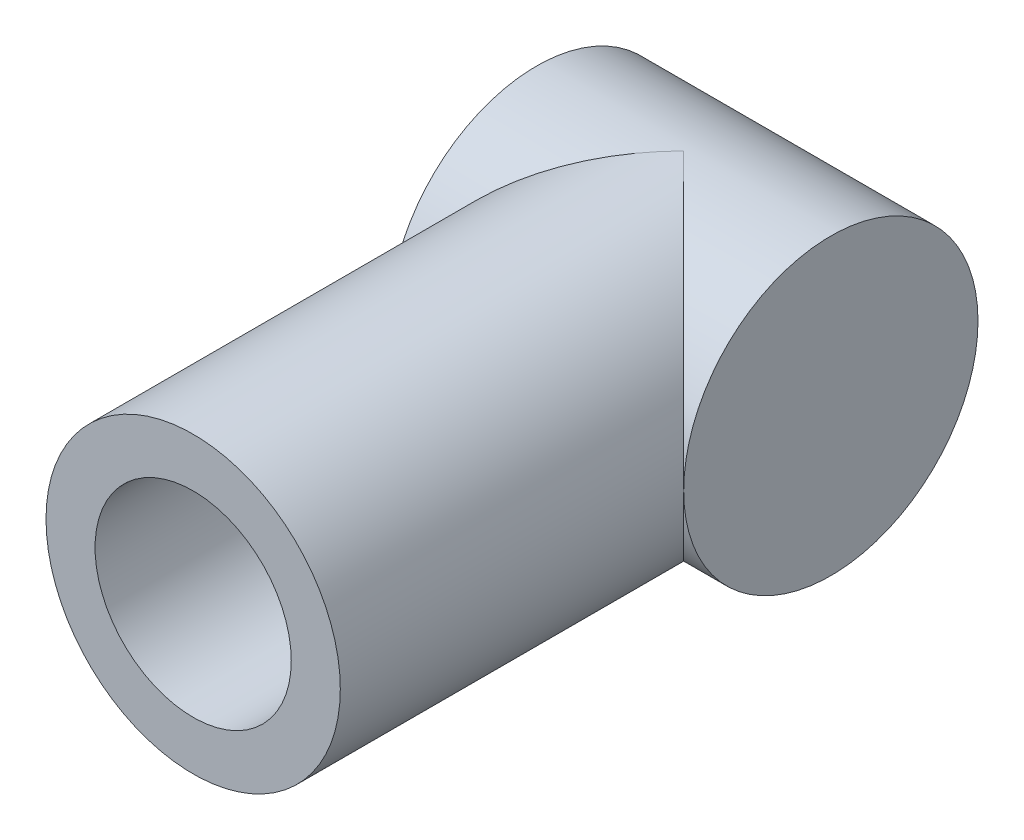
ISO-10303-21;
HEADER;
FILE_DESCRIPTION(('STEP AP214'),'2;1');
FILE_NAME('part.step','',(''),(''),'','','');
FILE_SCHEMA(('AUTOMOTIVE_DESIGN { 1 0 10303 214 1 1 1 1 }'));
ENDSEC;
DATA;
#1=APPLICATION_CONTEXT('core data for automotive mechanical design processes');
#2=APPLICATION_PROTOCOL_DEFINITION('international standard','automotive_design',2000,#1);
#3=PRODUCT_CONTEXT('',#1,'mechanical');
#4=PRODUCT('Part','Part','',(#3));
#5=PRODUCT_RELATED_PRODUCT_CATEGORY('part','',(#4));
#6=PRODUCT_DEFINITION_FORMATION('','',#4);
#7=PRODUCT_DEFINITION_CONTEXT('part definition',#1,'design');
#8=PRODUCT_DEFINITION('design','',#6,#7);
#9=PRODUCT_DEFINITION_SHAPE('','',#8);
#10=(LENGTH_UNIT() NAMED_UNIT(*) SI_UNIT(.MILLI.,.METRE.));
#11=(NAMED_UNIT(*) PLANE_ANGLE_UNIT() SI_UNIT($,.RADIAN.));
#12=(NAMED_UNIT(*) SI_UNIT($,.STERADIAN.) SOLID_ANGLE_UNIT());
#13=UNCERTAINTY_MEASURE_WITH_UNIT(LENGTH_MEASURE(1.E-05),#10,'distance_accuracy_value','');
#14=(GEOMETRIC_REPRESENTATION_CONTEXT(3) GLOBAL_UNCERTAINTY_ASSIGNED_CONTEXT((#13)) GLOBAL_UNIT_ASSIGNED_CONTEXT((#10,
#11,#12)) REPRESENTATION_CONTEXT('',''));
#15=CARTESIAN_POINT('',(0.,0.,0.));
#16=DIRECTION('',(0.,0.,1.));
#17=DIRECTION('',(1.,0.,0.));
#18=AXIS2_PLACEMENT_3D('',#15,#16,#17);
#19=CARTESIAN_POINT('',(75.,0.,0.));
#20=DIRECTION('',(-1.,0.,0.));
#21=DIRECTION('',(0.,0.,1.));
#22=AXIS2_PLACEMENT_3D('',#19,#20,#21);
#23=CYLINDRICAL_SURFACE('',#22,75.);
#24=CARTESIAN_POINT('',(0.,0.,0.));
#25=DIRECTION('',(-0.707106781186547,0.,-0.707106781186547));
#26=DIRECTION('',(-0.707106781186547,0.,0.707106781186547));
#27=AXIS2_PLACEMENT_3D('',#24,#25,#26);
#28=ELLIPSE('',#27,106.066017177982,75.);
#29=CARTESIAN_POINT('',(0.,75.,0.));
#30=VERTEX_POINT('',#29);
#31=CARTESIAN_POINT('',(-75.,0.,75.));
#32=VERTEX_POINT('',#31);
#33=EDGE_CURVE('E58',#30,#32,#28,.F.);
#34=ORIENTED_EDGE('',*,*,#33,.F.);
#35=CARTESIAN_POINT('',(0.,0.,0.));
#36=DIRECTION('',(-0.707106781186547,0.,0.707106781186547));
#37=DIRECTION('',(-0.707106781186547,0.,-0.707106781186547));
#38=AXIS2_PLACEMENT_3D('',#35,#36,#37);
#39=ELLIPSE('',#38,106.066017177982,75.);
#40=CARTESIAN_POINT('',(75.,0.,75.));
#41=VERTEX_POINT('',#40);
#42=EDGE_CURVE('E52',#41,#30,#39,.T.);
#43=ORIENTED_EDGE('',*,*,#42,.F.);
#44=CARTESIAN_POINT('',(75.,0.,0.));
#45=DIRECTION('',(1.,0.,0.));
#46=DIRECTION('',(0.,0.,-1.));
#47=AXIS2_PLACEMENT_3D('',#44,#45,#46);
#48=CIRCLE('',#47,75.);
#49=EDGE_CURVE('E11',#41,#41,#48,.T.);
#50=ORIENTED_EDGE('',*,*,#49,.F.);
#51=CARTESIAN_POINT('',(0.,-75.,0.));
#52=VERTEX_POINT('',#51);
#53=EDGE_CURVE('E46',#52,#41,#39,.T.);
#54=ORIENTED_EDGE('',*,*,#53,.F.);
#55=EDGE_CURVE('E62',#32,#52,#28,.F.);
#56=ORIENTED_EDGE('',*,*,#55,.F.);
#57=CARTESIAN_POINT('',(-75.,0.,0.));
#58=DIRECTION('',(1.,0.,0.));
#59=DIRECTION('',(0.,0.,-1.));
#60=AXIS2_PLACEMENT_3D('',#57,#58,#59);
#61=CIRCLE('',#60,75.);
#62=EDGE_CURVE('E35',#32,#32,#61,.T.);
#63=ORIENTED_EDGE('',*,*,#62,.T.);
#64=EDGE_LOOP('',(#34,#43,#50,#54,#56,#63));
#65=FACE_BOUND('',#64,.T.);
#66=ADVANCED_FACE('F32',(#65),#23,.T.);
#67=CARTESIAN_POINT('',(75.,0.,0.));
#68=DIRECTION('',(1.,0.,0.));
#69=DIRECTION('',(0.,0.,-1.));
#70=AXIS2_PLACEMENT_3D('',#67,#68,#69);
#71=PLANE('',#70);
#72=ORIENTED_EDGE('',*,*,#49,.T.);
#73=EDGE_LOOP('',(#72));
#74=FACE_BOUND('',#73,.T.);
#75=ADVANCED_FACE('F96',(#74),#71,.T.);
#76=CARTESIAN_POINT('',(-75.,0.,0.));
#77=DIRECTION('',(1.,0.,0.));
#78=DIRECTION('',(0.,0.,-1.));
#79=AXIS2_PLACEMENT_3D('',#76,#77,#78);
#80=PLANE('',#79);
#81=ORIENTED_EDGE('',*,*,#62,.F.);
#82=EDGE_LOOP('',(#81));
#83=FACE_BOUND('',#82,.T.);
#84=ADVANCED_FACE('F91',(#83),#80,.F.);
#85=CARTESIAN_POINT('',(0.,0.,250.));
#86=DIRECTION('',(0.,0.,-1.));
#87=DIRECTION('',(-1.,0.,0.));
#88=AXIS2_PLACEMENT_3D('',#85,#86,#87);
#89=CYLINDRICAL_SURFACE('',#88,75.);
#90=CARTESIAN_POINT('',(0.,0.,250.));
#91=DIRECTION('',(0.,0.,1.));
#92=DIRECTION('',(1.,0.,0.));
#93=AXIS2_PLACEMENT_3D('',#90,#91,#92);
#94=CIRCLE('',#93,75.);
#95=CARTESIAN_POINT('',(75.,0.,250.));
#96=VERTEX_POINT('',#95);
#97=EDGE_CURVE('E66',#96,#96,#94,.T.);
#98=ORIENTED_EDGE('',*,*,#97,.F.);
#99=EDGE_LOOP('',(#98));
#100=FACE_BOUND('',#99,.T.);
#101=ORIENTED_EDGE('',*,*,#42,.T.);
#102=ORIENTED_EDGE('',*,*,#33,.T.);
#103=ORIENTED_EDGE('',*,*,#55,.T.);
#104=ORIENTED_EDGE('',*,*,#53,.T.);
#105=EDGE_LOOP('',(#101,#102,#103,#104));
#106=FACE_BOUND('',#105,.T.);
#107=ADVANCED_FACE('F63',(#100,#106),#89,.T.);
#108=CARTESIAN_POINT('',(0.,0.,250.));
#109=DIRECTION('',(0.,0.,1.));
#110=DIRECTION('',(1.,0.,0.));
#111=AXIS2_PLACEMENT_3D('',#108,#109,#110);
#112=PLANE('',#111);
#113=CARTESIAN_POINT('',(0.,0.,250.));
#114=DIRECTION('',(0.,0.,1.));
#115=DIRECTION('',(1.,0.,0.));
#116=AXIS2_PLACEMENT_3D('',#113,#114,#115);
#117=CIRCLE('',#116,50.);
#118=CARTESIAN_POINT('',(50.,0.,250.));
#119=VERTEX_POINT('',#118);
#120=EDGE_CURVE('E70',#119,#119,#117,.T.);
#121=ORIENTED_EDGE('',*,*,#120,.F.);
#122=EDGE_LOOP('',(#121));
#123=FACE_BOUND('',#122,.T.);
#124=ORIENTED_EDGE('',*,*,#97,.T.);
#125=EDGE_LOOP('',(#124));
#126=FACE_BOUND('',#125,.T.);
#127=ADVANCED_FACE('F81',(#123,#126),#112,.T.);
#128=CARTESIAN_POINT('',(0.,0.,100.));
#129=DIRECTION('',(0.,0.,1.));
#130=DIRECTION('',(1.,0.,0.));
#131=AXIS2_PLACEMENT_3D('',#128,#129,#130);
#132=CYLINDRICAL_SURFACE('',#131,50.);
#133=CARTESIAN_POINT('',(0.,0.,100.));
#134=DIRECTION('',(0.,0.,1.));
#135=DIRECTION('',(1.,0.,0.));
#136=AXIS2_PLACEMENT_3D('',#133,#134,#135);
#137=CIRCLE('',#136,50.);
#138=CARTESIAN_POINT('',(50.,0.,100.));
#139=VERTEX_POINT('',#138);
#140=EDGE_CURVE('E69',#139,#139,#137,.T.);
#141=ORIENTED_EDGE('',*,*,#140,.F.);
#142=EDGE_LOOP('',(#141));
#143=FACE_BOUND('',#142,.T.);
#144=ORIENTED_EDGE('',*,*,#120,.T.);
#145=EDGE_LOOP('',(#144));
#146=FACE_BOUND('',#145,.T.);
#147=ADVANCED_FACE('F78',(#143,#146),#132,.F.);
#148=CARTESIAN_POINT('',(0.,0.,100.));
#149=DIRECTION('',(0.,0.,1.));
#150=DIRECTION('',(1.,0.,0.));
#151=AXIS2_PLACEMENT_3D('',#148,#149,#150);
#152=PLANE('',#151);
#153=ORIENTED_EDGE('',*,*,#140,.T.);
#154=EDGE_LOOP('',(#153));
#155=FACE_BOUND('',#154,.T.);
#156=ADVANCED_FACE('F76',(#155),#152,.T.);
#157=CLOSED_SHELL('',(#66,#75,#84,#107,#127,#147,#156));
#158=MANIFOLD_SOLID_BREP('B2',#157);
#159=ADVANCED_BREP_SHAPE_REPRESENTATION('',(#18,#158),#14);
#160=SHAPE_DEFINITION_REPRESENTATION(#9,#159);
ENDSEC;
END-ISO-10303-21;
